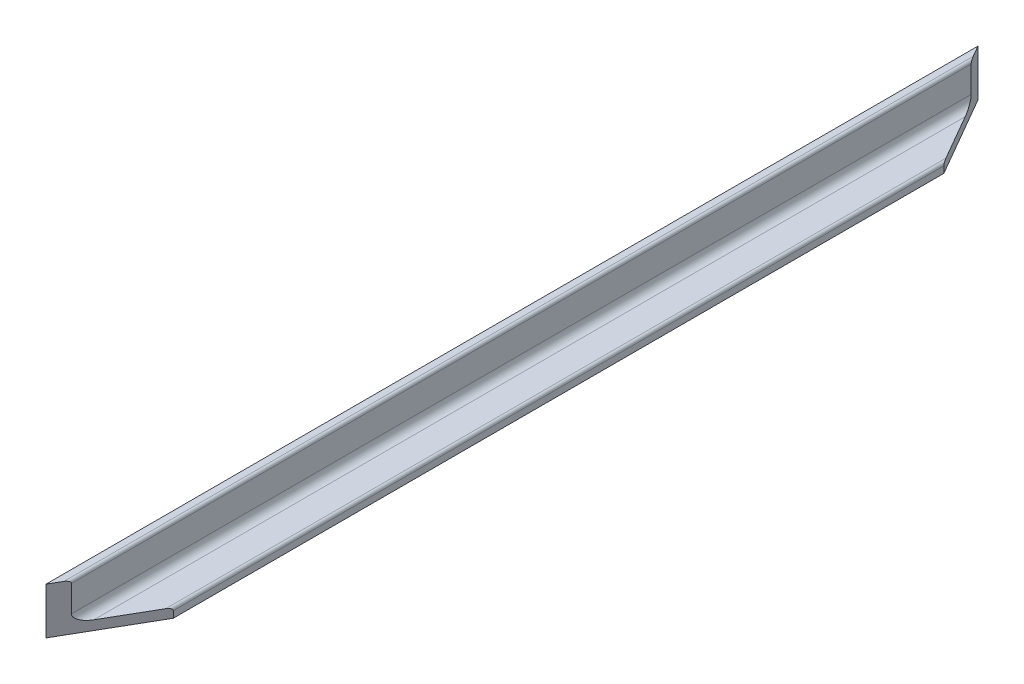
ISO-10303-21;
HEADER;
FILE_DESCRIPTION(('STEP AP214'),'2;1');
FILE_NAME('part.step','',(''),(''),'','','');
FILE_SCHEMA(('AUTOMOTIVE_DESIGN { 1 0 10303 214 1 1 1 1 }'));
ENDSEC;
DATA;
#1=APPLICATION_CONTEXT('core data for automotive mechanical design processes');
#2=APPLICATION_PROTOCOL_DEFINITION('international standard','automotive_design',2000,#1);
#3=PRODUCT_CONTEXT('',#1,'mechanical');
#4=PRODUCT('Part','Part','',(#3));
#5=PRODUCT_RELATED_PRODUCT_CATEGORY('part','',(#4));
#6=PRODUCT_DEFINITION_FORMATION('','',#4);
#7=PRODUCT_DEFINITION_CONTEXT('part definition',#1,'design');
#8=PRODUCT_DEFINITION('design','',#6,#7);
#9=PRODUCT_DEFINITION_SHAPE('','',#8);
#10=(LENGTH_UNIT() NAMED_UNIT(*) SI_UNIT(.MILLI.,.METRE.));
#11=(NAMED_UNIT(*) PLANE_ANGLE_UNIT() SI_UNIT($,.RADIAN.));
#12=(NAMED_UNIT(*) SI_UNIT($,.STERADIAN.) SOLID_ANGLE_UNIT());
#13=UNCERTAINTY_MEASURE_WITH_UNIT(LENGTH_MEASURE(1.E-05),#10,'distance_accuracy_value','');
#14=(GEOMETRIC_REPRESENTATION_CONTEXT(3) GLOBAL_UNCERTAINTY_ASSIGNED_CONTEXT((#13)) GLOBAL_UNIT_ASSIGNED_CONTEXT((#10,
#11,#12)) REPRESENTATION_CONTEXT('',''));
#15=CARTESIAN_POINT('',(0.,0.,0.));
#16=DIRECTION('',(0.,0.,1.));
#17=DIRECTION('',(1.,0.,0.));
#18=AXIS2_PLACEMENT_3D('',#15,#16,#17);
#19=CARTESIAN_POINT('',(-4.7,12.5,400.));
#20=DIRECTION('',(0.,-1.,0.));
#21=DIRECTION('',(0.,0.,-1.));
#22=AXIS2_PLACEMENT_3D('',#19,#20,#21);
#23=PLANE('',#22);
#24=DIRECTION('',(0.,0.,-1.));
#25=VECTOR('',#24,1.);
#26=CARTESIAN_POINT('',(-7.5,12.5,400.));
#27=LINE('',#26,#25);
#28=CARTESIAN_POINT('',(-7.5,12.5,400.));
#29=VERTEX_POINT('',#28);
#30=CARTESIAN_POINT('',(-7.49999999999998,12.5,0.));
#31=VERTEX_POINT('',#30);
#32=EDGE_CURVE('E11',#29,#31,#27,.T.);
#33=ORIENTED_EDGE('',*,*,#32,.F.);
#34=DIRECTION('',(0.499999999999995,0.,-0.866025403784442));
#35=VECTOR('',#34,1.);
#36=CARTESIAN_POINT('',(-7.49999999999998,12.5,400.));
#37=LINE('',#36,#35);
#38=CARTESIAN_POINT('',(-4.7,12.5,395.150257738807));
#39=VERTEX_POINT('',#38);
#40=EDGE_CURVE('E50',#29,#39,#37,.T.);
#41=ORIENTED_EDGE('',*,*,#40,.T.);
#42=DIRECTION('',(0.,0.,-1.));
#43=VECTOR('',#42,1.);
#44=CARTESIAN_POINT('',(-4.7,12.5,400.));
#45=LINE('',#44,#43);
#46=CARTESIAN_POINT('',(-4.69999999999999,12.5,4.84974226119295));
#47=VERTEX_POINT('',#46);
#48=EDGE_CURVE('E107',#39,#47,#45,.T.);
#49=ORIENTED_EDGE('',*,*,#48,.T.);
#50=DIRECTION('',(-0.499999999999994,0.,-0.866025403784442));
#51=VECTOR('',#50,1.);
#52=CARTESIAN_POINT('',(12.5,12.5,34.6410161513781));
#53=LINE('',#52,#51);
#54=EDGE_CURVE('E151',#47,#31,#53,.T.);
#55=ORIENTED_EDGE('',*,*,#54,.T.);
#56=EDGE_LOOP('',(#33,#41,#49,#55));
#57=FACE_BOUND('',#56,.T.);
#58=ADVANCED_FACE('F36',(#57),#23,.F.);
#59=CARTESIAN_POINT('',(-7.5,12.5,400.));
#60=DIRECTION('',(1.,0.,0.));
#61=DIRECTION('',(0.,1.,0.));
#62=AXIS2_PLACEMENT_3D('',#59,#60,#61);
#63=PLANE('',#62);
#64=DIRECTION('',(0.,-1.,0.));
#65=VECTOR('',#64,1.);
#66=CARTESIAN_POINT('',(-7.5,12.5,0.));
#67=LINE('',#66,#65);
#68=CARTESIAN_POINT('',(-7.49999999999999,-7.49999999999999,0.));
#69=VERTEX_POINT('',#68);
#70=EDGE_CURVE('E108',#31,#69,#67,.T.);
#71=ORIENTED_EDGE('',*,*,#70,.T.);
#72=DIRECTION('',(0.,0.,-1.));
#73=VECTOR('',#72,1.);
#74=CARTESIAN_POINT('',(-7.49999999999999,-7.49999999999999,400.));
#75=LINE('',#74,#73);
#76=CARTESIAN_POINT('',(-7.49999999999999,-7.49999999999999,400.));
#77=VERTEX_POINT('',#76);
#78=EDGE_CURVE('E44',#77,#69,#75,.T.);
#79=ORIENTED_EDGE('',*,*,#78,.F.);
#80=DIRECTION('',(0.,-1.,0.));
#81=VECTOR('',#80,1.);
#82=CARTESIAN_POINT('',(-7.5,12.5,400.));
#83=LINE('',#82,#81);
#84=EDGE_CURVE('E99',#29,#77,#83,.T.);
#85=ORIENTED_EDGE('',*,*,#84,.F.);
#86=ORIENTED_EDGE('',*,*,#32,.T.);
#87=EDGE_LOOP('',(#71,#79,#85,#86));
#88=FACE_BOUND('',#87,.T.);
#89=ADVANCED_FACE('F118',(#88),#63,.F.);
#90=CARTESIAN_POINT('',(-7.49999999999999,-7.49999999999999,400.));
#91=DIRECTION('',(0.,1.,0.));
#92=DIRECTION('',(-1.,0.,0.));
#93=AXIS2_PLACEMENT_3D('',#90,#91,#92);
#94=PLANE('',#93);
#95=DIRECTION('',(0.,0.,-1.));
#96=VECTOR('',#95,1.);
#97=CARTESIAN_POINT('',(12.5,-7.5,400.));
#98=LINE('',#97,#96);
#99=CARTESIAN_POINT('',(12.5,-7.5,365.358983848622));
#100=VERTEX_POINT('',#99);
#101=CARTESIAN_POINT('',(12.5,-7.5,34.6410161513781));
#102=VERTEX_POINT('',#101);
#103=EDGE_CURVE('E115',#100,#102,#98,.T.);
#104=ORIENTED_EDGE('',*,*,#103,.F.);
#105=DIRECTION('',(0.499999999999995,0.,-0.866025403784442));
#106=VECTOR('',#105,1.);
#107=CARTESIAN_POINT('',(-7.49999999999999,-7.49999999999999,400.));
#108=LINE('',#107,#106);
#109=EDGE_CURVE('E102',#77,#100,#108,.T.);
#110=ORIENTED_EDGE('',*,*,#109,.F.);
#111=ORIENTED_EDGE('',*,*,#78,.T.);
#112=DIRECTION('',(-0.499999999999994,0.,-0.866025403784442));
#113=VECTOR('',#112,1.);
#114=CARTESIAN_POINT('',(12.5,-7.5,34.6410161513781));
#115=LINE('',#114,#113);
#116=EDGE_CURVE('E152',#102,#69,#115,.T.);
#117=ORIENTED_EDGE('',*,*,#116,.F.);
#118=EDGE_LOOP('',(#104,#110,#111,#117));
#119=FACE_BOUND('',#118,.T.);
#120=ADVANCED_FACE('F113',(#119),#94,.F.);
#121=CARTESIAN_POINT('',(12.5,-7.5,400.));
#122=DIRECTION('',(-1.,0.,0.));
#123=DIRECTION('',(0.,-1.,0.));
#124=AXIS2_PLACEMENT_3D('',#121,#122,#123);
#125=PLANE('',#124);
#126=DIRECTION('',(0.,0.,-1.));
#127=VECTOR('',#126,1.);
#128=CARTESIAN_POINT('',(12.5,-4.7,400.));
#129=LINE('',#128,#127);
#130=CARTESIAN_POINT('',(12.5,-4.7,365.358983848622));
#131=VERTEX_POINT('',#130);
#132=CARTESIAN_POINT('',(12.5,-4.7,34.6410161513781));
#133=VERTEX_POINT('',#132);
#134=EDGE_CURVE('E119',#131,#133,#129,.T.);
#135=ORIENTED_EDGE('',*,*,#134,.F.);
#136=DIRECTION('',(0.,-1.,0.));
#137=VECTOR('',#136,1.);
#138=CARTESIAN_POINT('',(12.5,12.5,365.358983848622));
#139=LINE('',#138,#137);
#140=EDGE_CURVE('E171',#131,#100,#139,.T.);
#141=ORIENTED_EDGE('',*,*,#140,.T.);
#142=ORIENTED_EDGE('',*,*,#103,.T.);
#143=DIRECTION('',(0.,-1.,0.));
#144=VECTOR('',#143,1.);
#145=CARTESIAN_POINT('',(12.5,12.5,34.6410161513781));
#146=LINE('',#145,#144);
#147=EDGE_CURVE('E148',#133,#102,#146,.T.);
#148=ORIENTED_EDGE('',*,*,#147,.F.);
#149=EDGE_LOOP('',(#135,#141,#142,#148));
#150=FACE_BOUND('',#149,.T.);
#151=ADVANCED_FACE('F200',(#150),#125,.F.);
#152=CARTESIAN_POINT('',(11.3,-4.7,400.));
#153=DIRECTION('',(0.,0.,-1.));
#154=DIRECTION('',(-1.,0.,0.));
#155=AXIS2_PLACEMENT_3D('',#152,#153,#154);
#156=CYLINDRICAL_SURFACE('',#155,1.2);
#157=DIRECTION('',(0.,0.,-1.));
#158=VECTOR('',#157,1.);
#159=CARTESIAN_POINT('',(11.3,-3.5,400.));
#160=LINE('',#159,#158);
#161=CARTESIAN_POINT('',(11.3,-3.5,367.437444817705));
#162=VERTEX_POINT('',#161);
#163=CARTESIAN_POINT('',(11.3,-3.5,32.5625551822954));
#164=VERTEX_POINT('',#163);
#165=EDGE_CURVE('E123',#162,#164,#160,.T.);
#166=ORIENTED_EDGE('',*,*,#165,.F.);
#167=CARTESIAN_POINT('',(11.3,-4.7,367.437444817705));
#168=DIRECTION('',(-0.866025403784442,0.,-0.499999999999995));
#169=DIRECTION('',(0.499999999999995,0.,-0.866025403784441));
#170=AXIS2_PLACEMENT_3D('',#167,#168,#169);
#171=ELLIPSE('',#170,2.40000000000003,1.2);
#172=EDGE_CURVE('E154',#162,#131,#171,.T.);
#173=ORIENTED_EDGE('',*,*,#172,.T.);
#174=ORIENTED_EDGE('',*,*,#134,.T.);
#175=CARTESIAN_POINT('',(11.3,-4.7,32.5625551822954));
#176=DIRECTION('',(-0.866025403784442,0.,0.499999999999994));
#177=DIRECTION('',(-0.499999999999994,0.,-0.866025403784442));
#178=AXIS2_PLACEMENT_3D('',#175,#176,#177);
#179=ELLIPSE('',#178,2.40000000000004,1.2);
#180=EDGE_CURVE('E132',#133,#164,#179,.T.);
#181=ORIENTED_EDGE('',*,*,#180,.T.);
#182=EDGE_LOOP('',(#166,#173,#174,#181));
#183=FACE_BOUND('',#182,.T.);
#184=ADVANCED_FACE('F196',(#183),#156,.T.);
#185=CARTESIAN_POINT('',(11.3,-3.5,400.));
#186=DIRECTION('',(0.,-1.,0.));
#187=DIRECTION('',(0.,0.,-1.));
#188=AXIS2_PLACEMENT_3D('',#185,#186,#187);
#189=PLANE('',#188);
#190=DIRECTION('',(0.,0.,-1.));
#191=VECTOR('',#190,1.);
#192=CARTESIAN_POINT('',(0.,-3.5,400.));
#193=LINE('',#192,#191);
#194=CARTESIAN_POINT('',(0.,-3.5,387.009618943233));
#195=VERTEX_POINT('',#194);
#196=CARTESIAN_POINT('',(0.,-3.5,12.9903810567668));
#197=VERTEX_POINT('',#196);
#198=EDGE_CURVE('E125',#195,#197,#193,.T.);
#199=ORIENTED_EDGE('',*,*,#198,.F.);
#200=DIRECTION('',(0.499999999999995,0.,-0.866025403784441));
#201=VECTOR('',#200,1.);
#202=CARTESIAN_POINT('',(-2.80000000000009,-3.5,391.859361204426));
#203=LINE('',#202,#201);
#204=EDGE_CURVE('E159',#195,#162,#203,.T.);
#205=ORIENTED_EDGE('',*,*,#204,.T.);
#206=ORIENTED_EDGE('',*,*,#165,.T.);
#207=DIRECTION('',(-0.499999999999994,0.,-0.866025403784442));
#208=VECTOR('',#207,1.);
#209=CARTESIAN_POINT('',(170.405080756886,-3.5,308.140638795576));
#210=LINE('',#209,#208);
#211=EDGE_CURVE('E136',#164,#197,#210,.T.);
#212=ORIENTED_EDGE('',*,*,#211,.T.);
#213=EDGE_LOOP('',(#199,#205,#206,#212));
#214=FACE_BOUND('',#213,.T.);
#215=ADVANCED_FACE('F193',(#214),#189,.F.);
#216=CARTESIAN_POINT('',(0.,0.,400.));
#217=DIRECTION('',(0.,0.,-1.));
#218=DIRECTION('',(-1.,0.,0.));
#219=AXIS2_PLACEMENT_3D('',#216,#217,#218);
#220=CYLINDRICAL_SURFACE('',#219,3.5);
#221=DIRECTION('',(0.,0.,-1.));
#222=VECTOR('',#221,1.);
#223=CARTESIAN_POINT('',(-3.5,0.,400.));
#224=LINE('',#223,#222);
#225=CARTESIAN_POINT('',(-3.5,0.,393.071796769724));
#226=VERTEX_POINT('',#225);
#227=CARTESIAN_POINT('',(-3.5,0.,6.9282032302756));
#228=VERTEX_POINT('',#227);
#229=EDGE_CURVE('E127',#226,#228,#224,.T.);
#230=ORIENTED_EDGE('',*,*,#229,.F.);
#231=CARTESIAN_POINT('',(0.,0.,387.009618943233));
#232=DIRECTION('',(-0.866025403784442,0.,-0.499999999999995));
#233=DIRECTION('',(0.499999999999995,0.,-0.866025403784441));
#234=AXIS2_PLACEMENT_3D('',#231,#232,#233);
#235=ELLIPSE('',#234,7.00000000000007,3.5);
#236=EDGE_CURVE('E162',#226,#195,#235,.F.);
#237=ORIENTED_EDGE('',*,*,#236,.T.);
#238=ORIENTED_EDGE('',*,*,#198,.T.);
#239=CARTESIAN_POINT('',(0.,0.,12.9903810567668));
#240=DIRECTION('',(-0.866025403784442,0.,0.499999999999994));
#241=DIRECTION('',(-0.499999999999994,0.,-0.866025403784442));
#242=AXIS2_PLACEMENT_3D('',#239,#240,#241);
#243=ELLIPSE('',#242,7.00000000000009,3.5);
#244=EDGE_CURVE('E139',#197,#228,#243,.F.);
#245=ORIENTED_EDGE('',*,*,#244,.T.);
#246=EDGE_LOOP('',(#230,#237,#238,#245));
#247=FACE_BOUND('',#246,.T.);
#248=ADVANCED_FACE('F188',(#247),#220,.F.);
#249=CARTESIAN_POINT('',(-3.5,0.,400.));
#250=DIRECTION('',(-1.,0.,0.));
#251=DIRECTION('',(0.,0.,1.));
#252=AXIS2_PLACEMENT_3D('',#249,#250,#251);
#253=PLANE('',#252);
#254=DIRECTION('',(0.,0.,-1.));
#255=VECTOR('',#254,1.);
#256=CARTESIAN_POINT('',(-3.5,11.3,400.));
#257=LINE('',#256,#255);
#258=CARTESIAN_POINT('',(-3.5,11.3,393.071796769724));
#259=VERTEX_POINT('',#258);
#260=CARTESIAN_POINT('',(-3.5,11.3,6.9282032302756));
#261=VERTEX_POINT('',#260);
#262=EDGE_CURVE('E129',#259,#261,#257,.T.);
#263=ORIENTED_EDGE('',*,*,#262,.F.);
#264=DIRECTION('',(0.,-1.,0.));
#265=VECTOR('',#264,1.);
#266=CARTESIAN_POINT('',(-3.5,0.,393.071796769724));
#267=LINE('',#266,#265);
#268=EDGE_CURVE('E165',#259,#226,#267,.T.);
#269=ORIENTED_EDGE('',*,*,#268,.T.);
#270=ORIENTED_EDGE('',*,*,#229,.T.);
#271=DIRECTION('',(0.,1.,0.));
#272=VECTOR('',#271,1.);
#273=CARTESIAN_POINT('',(-3.5,-2.1192087079193E-13,6.9282032302756));
#274=LINE('',#273,#272);
#275=EDGE_CURVE('E142',#228,#261,#274,.T.);
#276=ORIENTED_EDGE('',*,*,#275,.T.);
#277=EDGE_LOOP('',(#263,#269,#270,#276));
#278=FACE_BOUND('',#277,.T.);
#279=ADVANCED_FACE('F185',(#278),#253,.F.);
#280=CARTESIAN_POINT('',(-4.7,11.3,400.));
#281=DIRECTION('',(0.,0.,-1.));
#282=DIRECTION('',(-1.,0.,0.));
#283=AXIS2_PLACEMENT_3D('',#280,#281,#282);
#284=CYLINDRICAL_SURFACE('',#283,1.2);
#285=ORIENTED_EDGE('',*,*,#48,.F.);
#286=CARTESIAN_POINT('',(-4.7,11.3,395.150257738807));
#287=DIRECTION('',(-0.866025403784442,0.,-0.499999999999995));
#288=DIRECTION('',(0.499999999999995,0.,-0.866025403784441));
#289=AXIS2_PLACEMENT_3D('',#286,#287,#288);
#290=ELLIPSE('',#289,2.40000000000002,1.2);
#291=EDGE_CURVE('E168',#39,#259,#290,.T.);
#292=ORIENTED_EDGE('',*,*,#291,.T.);
#293=ORIENTED_EDGE('',*,*,#262,.T.);
#294=CARTESIAN_POINT('',(-4.7,11.3,4.84974226119289));
#295=DIRECTION('',(-0.866025403784442,0.,0.499999999999994));
#296=DIRECTION('',(-0.499999999999994,0.,-0.866025403784442));
#297=AXIS2_PLACEMENT_3D('',#294,#295,#296);
#298=ELLIPSE('',#297,2.40000000000003,1.2);
#299=EDGE_CURVE('E145',#261,#47,#298,.T.);
#300=ORIENTED_EDGE('',*,*,#299,.T.);
#301=EDGE_LOOP('',(#285,#292,#293,#300));
#302=FACE_BOUND('',#301,.T.);
#303=ADVANCED_FACE('F177',(#302),#284,.T.);
#304=CARTESIAN_POINT('',(12.5,12.5,34.6410161513781));
#305=DIRECTION('',(-0.866025403784442,0.,0.499999999999994));
#306=DIRECTION('',(0.499999999999994,0.,0.866025403784442));
#307=AXIS2_PLACEMENT_3D('',#304,#305,#306);
#308=PLANE('',#307);
#309=ORIENTED_EDGE('',*,*,#147,.T.);
#310=ORIENTED_EDGE('',*,*,#116,.T.);
#311=ORIENTED_EDGE('',*,*,#70,.F.);
#312=ORIENTED_EDGE('',*,*,#54,.F.);
#313=ORIENTED_EDGE('',*,*,#299,.F.);
#314=ORIENTED_EDGE('',*,*,#275,.F.);
#315=ORIENTED_EDGE('',*,*,#244,.F.);
#316=ORIENTED_EDGE('',*,*,#211,.F.);
#317=ORIENTED_EDGE('',*,*,#180,.F.);
#318=EDGE_LOOP('',(#309,#310,#311,#312,#313,#314,#315,#316,#317));
#319=FACE_BOUND('',#318,.T.);
#320=ADVANCED_FACE('F182',(#319),#308,.F.);
#321=CARTESIAN_POINT('',(-7.49999999999998,12.5,400.));
#322=DIRECTION('',(-0.866025403784442,0.,-0.499999999999995));
#323=DIRECTION('',(-0.499999999999995,0.,0.866025403784441));
#324=AXIS2_PLACEMENT_3D('',#321,#322,#323);
#325=PLANE('',#324);
#326=ORIENTED_EDGE('',*,*,#204,.F.);
#327=ORIENTED_EDGE('',*,*,#236,.F.);
#328=ORIENTED_EDGE('',*,*,#268,.F.);
#329=ORIENTED_EDGE('',*,*,#291,.F.);
#330=ORIENTED_EDGE('',*,*,#40,.F.);
#331=ORIENTED_EDGE('',*,*,#84,.T.);
#332=ORIENTED_EDGE('',*,*,#109,.T.);
#333=ORIENTED_EDGE('',*,*,#140,.F.);
#334=ORIENTED_EDGE('',*,*,#172,.F.);
#335=EDGE_LOOP('',(#326,#327,#328,#329,#330,#331,#332,#333,#334));
#336=FACE_BOUND('',#335,.T.);
#337=ADVANCED_FACE('F101',(#336),#325,.F.);
#338=CLOSED_SHELL('',(#58,#89,#120,#151,#184,#215,#248,#279,#303,#320,#337));
#339=MANIFOLD_SOLID_BREP('B2',#338);
#340=ADVANCED_BREP_SHAPE_REPRESENTATION('',(#18,#339),#14);
#341=SHAPE_DEFINITION_REPRESENTATION(#9,#340);
ENDSEC;
END-ISO-10303-21;
